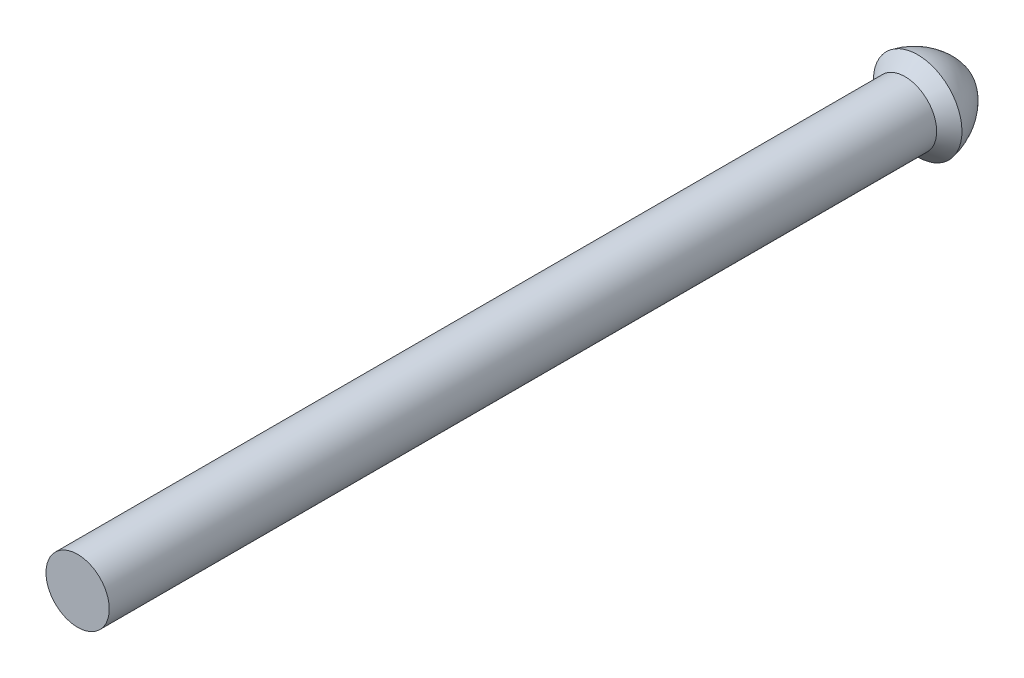
ISO-10303-21;
HEADER;
FILE_DESCRIPTION(('STEP AP214'),'2;1');
FILE_NAME('part.step','',(''),(''),'','','');
FILE_SCHEMA(('AUTOMOTIVE_DESIGN { 1 0 10303 214 1 1 1 1 }'));
ENDSEC;
DATA;
#1=APPLICATION_CONTEXT('core data for automotive mechanical design processes');
#2=APPLICATION_PROTOCOL_DEFINITION('international standard','automotive_design',2000,#1);
#3=PRODUCT_CONTEXT('',#1,'mechanical');
#4=PRODUCT('Part','Part','',(#3));
#5=PRODUCT_RELATED_PRODUCT_CATEGORY('part','',(#4));
#6=PRODUCT_DEFINITION_FORMATION('','',#4);
#7=PRODUCT_DEFINITION_CONTEXT('part definition',#1,'design');
#8=PRODUCT_DEFINITION('design','',#6,#7);
#9=PRODUCT_DEFINITION_SHAPE('','',#8);
#10=(LENGTH_UNIT() NAMED_UNIT(*) SI_UNIT(.MILLI.,.METRE.));
#11=(NAMED_UNIT(*) PLANE_ANGLE_UNIT() SI_UNIT($,.RADIAN.));
#12=(NAMED_UNIT(*) SI_UNIT($,.STERADIAN.) SOLID_ANGLE_UNIT());
#13=UNCERTAINTY_MEASURE_WITH_UNIT(LENGTH_MEASURE(1.E-05),#10,'distance_accuracy_value','');
#14=(GEOMETRIC_REPRESENTATION_CONTEXT(3) GLOBAL_UNCERTAINTY_ASSIGNED_CONTEXT((#13)) GLOBAL_UNIT_ASSIGNED_CONTEXT((#10,
#11,#12)) REPRESENTATION_CONTEXT('',''));
#15=CARTESIAN_POINT('',(0.,0.,0.));
#16=DIRECTION('',(0.,0.,1.));
#17=DIRECTION('',(1.,0.,0.));
#18=AXIS2_PLACEMENT_3D('',#15,#16,#17);
#19=CARTESIAN_POINT('',(0.,0.,0.));
#20=DIRECTION('',(0.,0.,-1.));
#21=DIRECTION('',(0.,1.,0.));
#22=AXIS2_PLACEMENT_3D('',#19,#20,#21);
#23=PLANE('',#22);
#24=CARTESIAN_POINT('',(0.,0.,0.));
#25=DIRECTION('',(0.,0.,1.));
#26=DIRECTION('',(0.,-1.,0.));
#27=AXIS2_PLACEMENT_3D('',#24,#25,#26);
#28=CIRCLE('',#27,3.81);
#29=CARTESIAN_POINT('',(0.,-3.81,0.));
#30=VERTEX_POINT('',#29);
#31=EDGE_CURVE('E65',#30,#30,#28,.T.);
#32=ORIENTED_EDGE('',*,*,#31,.T.);
#33=EDGE_LOOP('',(#32));
#34=FACE_BOUND('',#33,.T.);
#35=ADVANCED_FACE('F35',(#34),#23,.F.);
#36=CARTESIAN_POINT('',(0.,2.54,-99.6298533835525));
#37=DIRECTION('',(-1.,0.,0.));
#38=DIRECTION('',(0.,-1.,0.));
#39=AXIS2_PLACEMENT_3D('',#36,#37,#38);
#40=CIRCLE('',#39,8.02012792915425);
#41=TRIMMED_CURVE('',#40,(PARAMETER_VALUE(-1.24854460269553)),
(PARAMETER_VALUE(1.24854460269553)),.T.,.PARAMETER.);
#42=CARTESIAN_POINT('',(0.,0.,-99.6298533835525));
#43=DIRECTION('',(0.,0.,1.));
#44=AXIS1_PLACEMENT('',#42,#43);
#45=SURFACE_OF_REVOLUTION('',#41,#44);
#46=CARTESIAN_POINT('',(0.,0.,-101.153853383553));
#47=DIRECTION('',(0.,0.,1.));
#48=DIRECTION('',(0.,-1.,0.));
#49=AXIS2_PLACEMENT_3D('',#46,#47,#48);
#50=CIRCLE('',#49,5.334);
#51=CARTESIAN_POINT('',(0.,-5.334,-101.153853383553));
#52=VERTEX_POINT('',#51);
#53=EDGE_CURVE('E11',#52,#52,#50,.T.);
#54=ORIENTED_EDGE('',*,*,#53,.F.);
#55=EDGE_LOOP('',(#54));
#56=FACE_BOUND('',#55,.T.);
#57=CARTESIAN_POINT('',(0.,0.,-107.237142782543));
#58=VERTEX_POINT('',#57);
#59=VERTEX_LOOP('',#58);
#60=FACE_BOUND('',#59,.T.);
#61=ADVANCED_FACE('F44',(#56,#60),#45,.T.);
#62=CARTESIAN_POINT('',(0.,0.,-101.153853383553));
#63=DIRECTION('',(0.,0.,-1.));
#64=DIRECTION('',(0.,1.,0.));
#65=AXIS2_PLACEMENT_3D('',#62,#63,#64);
#66=CONICAL_SURFACE('',#65,5.334,0.785398163397449);
#67=CARTESIAN_POINT('',(0.,0.,-99.6298533835525));
#68=DIRECTION('',(0.,0.,1.));
#69=DIRECTION('',(0.,-1.,0.));
#70=AXIS2_PLACEMENT_3D('',#67,#68,#69);
#71=CIRCLE('',#70,3.81);
#72=CARTESIAN_POINT('',(0.,-3.81,-99.6298533835525));
#73=VERTEX_POINT('',#72);
#74=EDGE_CURVE('E41',#73,#73,#71,.T.);
#75=ORIENTED_EDGE('',*,*,#74,.F.);
#76=EDGE_LOOP('',(#75));
#77=FACE_BOUND('',#76,.T.);
#78=ORIENTED_EDGE('',*,*,#53,.T.);
#79=EDGE_LOOP('',(#78));
#80=FACE_BOUND('',#79,.T.);
#81=ADVANCED_FACE('F46',(#77,#80),#66,.T.);
#82=CARTESIAN_POINT('',(0.,0.,0.));
#83=DIRECTION('',(0.,0.,1.));
#84=DIRECTION('',(0.,-1.,0.));
#85=AXIS2_PLACEMENT_3D('',#82,#83,#84);
#86=CYLINDRICAL_SURFACE('',#85,3.81);
#87=ORIENTED_EDGE('',*,*,#31,.F.);
#88=EDGE_LOOP('',(#87));
#89=FACE_BOUND('',#88,.T.);
#90=ORIENTED_EDGE('',*,*,#74,.T.);
#91=EDGE_LOOP('',(#90));
#92=FACE_BOUND('',#91,.T.);
#93=ADVANCED_FACE('F52',(#89,#92),#86,.T.);
#94=CLOSED_SHELL('',(#35,#61,#81,#93));
#95=MANIFOLD_SOLID_BREP('B2',#94);
#96=ADVANCED_BREP_SHAPE_REPRESENTATION('',(#18,#95),#14);
#97=SHAPE_DEFINITION_REPRESENTATION(#9,#96);
ENDSEC;
END-ISO-10303-21;
